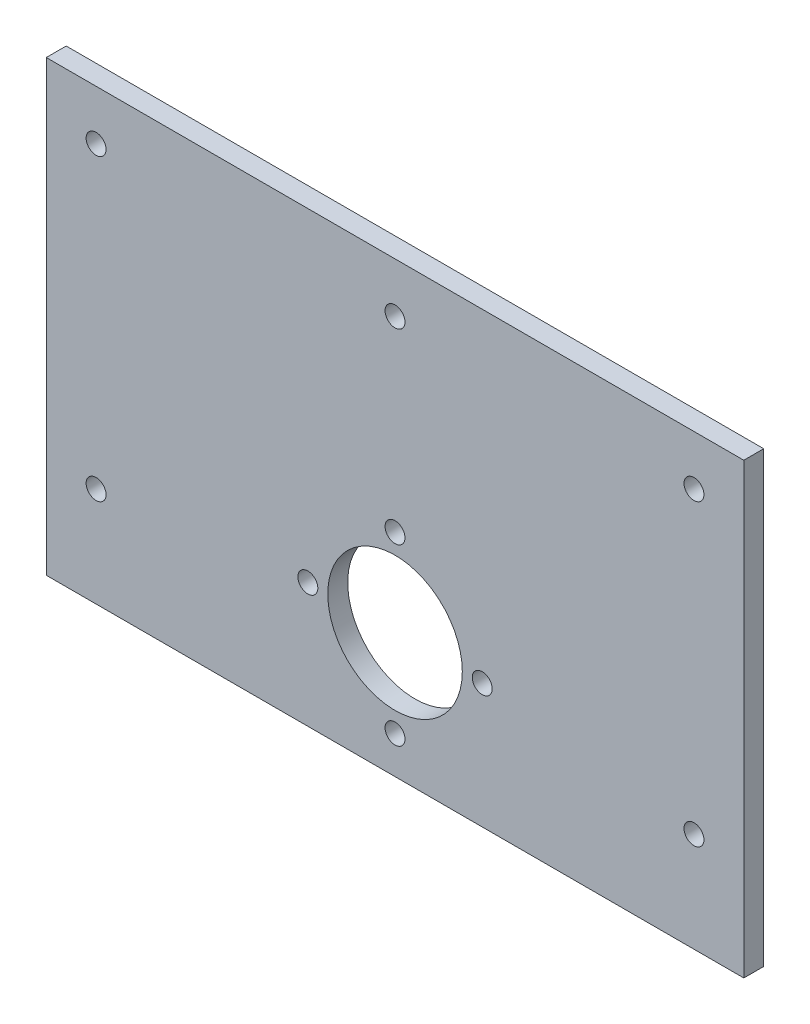
ISO-10303-21;
HEADER;
FILE_DESCRIPTION(('STEP AP214'),'2;1');
FILE_NAME('part.step','',(''),(''),'','','');
FILE_SCHEMA(('AUTOMOTIVE_DESIGN { 1 0 10303 214 1 1 1 1 }'));
ENDSEC;
DATA;
#1=APPLICATION_CONTEXT('core data for automotive mechanical design processes');
#2=APPLICATION_PROTOCOL_DEFINITION('international standard','automotive_design',2000,#1);
#3=PRODUCT_CONTEXT('',#1,'mechanical');
#4=PRODUCT('Part','Part','',(#3));
#5=PRODUCT_RELATED_PRODUCT_CATEGORY('part','',(#4));
#6=PRODUCT_DEFINITION_FORMATION('','',#4);
#7=PRODUCT_DEFINITION_CONTEXT('part definition',#1,'design');
#8=PRODUCT_DEFINITION('design','',#6,#7);
#9=PRODUCT_DEFINITION_SHAPE('','',#8);
#10=(LENGTH_UNIT() NAMED_UNIT(*) SI_UNIT(.MILLI.,.METRE.));
#11=(NAMED_UNIT(*) PLANE_ANGLE_UNIT() SI_UNIT($,.RADIAN.));
#12=(NAMED_UNIT(*) SI_UNIT($,.STERADIAN.) SOLID_ANGLE_UNIT());
#13=UNCERTAINTY_MEASURE_WITH_UNIT(LENGTH_MEASURE(1.E-05),#10,'distance_accuracy_value','');
#14=(GEOMETRIC_REPRESENTATION_CONTEXT(3) GLOBAL_UNCERTAINTY_ASSIGNED_CONTEXT((#13)) GLOBAL_UNIT_ASSIGNED_CONTEXT((#10,
#11,#12)) REPRESENTATION_CONTEXT('',''));
#15=CARTESIAN_POINT('',(0.,0.,0.));
#16=DIRECTION('',(0.,0.,1.));
#17=DIRECTION('',(1.,0.,0.));
#18=AXIS2_PLACEMENT_3D('',#15,#16,#17);
#19=CARTESIAN_POINT('',(0.,0.,4.));
#20=DIRECTION('',(0.,0.,-1.));
#21=DIRECTION('',(-1.,0.,0.));
#22=AXIS2_PLACEMENT_3D('',#19,#20,#21);
#23=PLANE('',#22);
#24=CARTESIAN_POINT('',(60.,-25.,4.));
#25=DIRECTION('',(0.,0.,1.));
#26=DIRECTION('',(-1.,0.,0.));
#27=AXIS2_PLACEMENT_3D('',#24,#25,#26);
#28=CIRCLE('',#27,2.);
#29=CARTESIAN_POINT('',(58.,-25.,4.));
#30=VERTEX_POINT('',#29);
#31=EDGE_CURVE('E202',#30,#30,#28,.T.);
#32=ORIENTED_EDGE('',*,*,#31,.F.);
#33=EDGE_LOOP('',(#32));
#34=FACE_BOUND('',#33,.T.);
#35=CARTESIAN_POINT('',(-60.,-25.,4.));
#36=DIRECTION('',(0.,0.,1.));
#37=DIRECTION('',(1.,0.,0.));
#38=AXIS2_PLACEMENT_3D('',#35,#36,#37);
#39=CIRCLE('',#38,2.);
#40=CARTESIAN_POINT('',(-58.,-25.,4.));
#41=VERTEX_POINT('',#40);
#42=EDGE_CURVE('E194',#41,#41,#39,.T.);
#43=ORIENTED_EDGE('',*,*,#42,.F.);
#44=EDGE_LOOP('',(#43));
#45=FACE_BOUND('',#44,.T.);
#46=CARTESIAN_POINT('',(60.,35.,4.));
#47=DIRECTION('',(0.,0.,1.));
#48=DIRECTION('',(1.,0.,0.));
#49=AXIS2_PLACEMENT_3D('',#46,#47,#48);
#50=CIRCLE('',#49,2.);
#51=CARTESIAN_POINT('',(62.,35.,4.));
#52=VERTEX_POINT('',#51);
#53=EDGE_CURVE('E178',#52,#52,#50,.T.);
#54=ORIENTED_EDGE('',*,*,#53,.F.);
#55=EDGE_LOOP('',(#54));
#56=FACE_BOUND('',#55,.T.);
#57=CARTESIAN_POINT('',(-60.,35.,4.));
#58=DIRECTION('',(0.,0.,1.));
#59=DIRECTION('',(1.,0.,0.));
#60=AXIS2_PLACEMENT_3D('',#57,#58,#59);
#61=CIRCLE('',#60,2.);
#62=CARTESIAN_POINT('',(-58.,35.,4.));
#63=VERTEX_POINT('',#62);
#64=EDGE_CURVE('E187',#63,#63,#61,.T.);
#65=ORIENTED_EDGE('',*,*,#64,.F.);
#66=EDGE_LOOP('',(#65));
#67=FACE_BOUND('',#66,.T.);
#68=CARTESIAN_POINT('',(0.,35.,4.));
#69=DIRECTION('',(0.,0.,1.));
#70=DIRECTION('',(1.,0.,0.));
#71=AXIS2_PLACEMENT_3D('',#68,#69,#70);
#72=CIRCLE('',#71,2.);
#73=CARTESIAN_POINT('',(2.00000000000002,35.,4.));
#74=VERTEX_POINT('',#73);
#75=EDGE_CURVE('E170',#74,#74,#72,.T.);
#76=ORIENTED_EDGE('',*,*,#75,.F.);
#77=EDGE_LOOP('',(#76));
#78=FACE_BOUND('',#77,.T.);
#79=DIRECTION('',(0.,1.,0.));
#80=VECTOR('',#79,1.);
#81=CARTESIAN_POINT('',(70.0000000000001,-45.,4.));
#82=LINE('',#81,#80);
#83=CARTESIAN_POINT('',(70.0000000000001,-45.,4.));
#84=VERTEX_POINT('',#83);
#85=CARTESIAN_POINT('',(70.,45.,4.));
#86=VERTEX_POINT('',#85);
#87=EDGE_CURVE('E92',#84,#86,#82,.T.);
#88=ORIENTED_EDGE('',*,*,#87,.T.);
#89=DIRECTION('',(-1.,0.,0.));
#90=VECTOR('',#89,1.);
#91=CARTESIAN_POINT('',(-70.,45.,4.));
#92=LINE('',#91,#90);
#93=CARTESIAN_POINT('',(-70.,45.,4.));
#94=VERTEX_POINT('',#93);
#95=EDGE_CURVE('E87',#86,#94,#92,.T.);
#96=ORIENTED_EDGE('',*,*,#95,.T.);
#97=DIRECTION('',(0.,-1.,0.));
#98=VECTOR('',#97,1.);
#99=CARTESIAN_POINT('',(-70.,-45.,4.));
#100=LINE('',#99,#98);
#101=CARTESIAN_POINT('',(-70.,-45.,4.));
#102=VERTEX_POINT('',#101);
#103=EDGE_CURVE('E90',#94,#102,#100,.T.);
#104=ORIENTED_EDGE('',*,*,#103,.T.);
#105=DIRECTION('',(1.,0.,0.));
#106=VECTOR('',#105,1.);
#107=CARTESIAN_POINT('',(-70.,-45.,4.));
#108=LINE('',#107,#106);
#109=EDGE_CURVE('E57',#102,#84,#108,.T.);
#110=ORIENTED_EDGE('',*,*,#109,.T.);
#111=EDGE_LOOP('',(#88,#96,#104,#110));
#112=FACE_BOUND('',#111,.T.);
#113=CARTESIAN_POINT('',(-2.81942531270712E-13,-2.5,4.));
#114=DIRECTION('',(0.,0.,1.));
#115=DIRECTION('',(1.,0.,0.));
#116=AXIS2_PLACEMENT_3D('',#113,#114,#115);
#117=CIRCLE('',#116,1.99999999999999);
#118=CARTESIAN_POINT('',(1.99999999999971,-2.5,4.));
#119=VERTEX_POINT('',#118);
#120=EDGE_CURVE('E112',#119,#119,#117,.T.);
#121=ORIENTED_EDGE('',*,*,#120,.F.);
#122=EDGE_LOOP('',(#121));
#123=FACE_BOUND('',#122,.T.);
#124=CARTESIAN_POINT('',(-2.91433543964104E-13,-20.,4.));
#125=DIRECTION('',(0.,0.,1.));
#126=DIRECTION('',(1.,0.,0.));
#127=AXIS2_PLACEMENT_3D('',#124,#125,#126);
#128=CIRCLE('',#127,13.5);
#129=CARTESIAN_POINT('',(13.4999999999997,-20.,4.));
#130=VERTEX_POINT('',#129);
#131=EDGE_CURVE('E134',#130,#130,#128,.T.);
#132=ORIENTED_EDGE('',*,*,#131,.F.);
#133=EDGE_LOOP('',(#132));
#134=FACE_BOUND('',#133,.T.);
#135=CARTESIAN_POINT('',(17.4999999999997,-20.,4.));
#136=DIRECTION('',(0.,0.,1.));
#137=DIRECTION('',(1.,0.,0.));
#138=AXIS2_PLACEMENT_3D('',#135,#136,#137);
#139=CIRCLE('',#138,2.);
#140=CARTESIAN_POINT('',(19.4999999999997,-20.,4.));
#141=VERTEX_POINT('',#140);
#142=EDGE_CURVE('E142',#141,#141,#139,.T.);
#143=ORIENTED_EDGE('',*,*,#142,.F.);
#144=EDGE_LOOP('',(#143));
#145=FACE_BOUND('',#144,.T.);
#146=CARTESIAN_POINT('',(-2.98781424758988E-13,-37.5,4.));
#147=DIRECTION('',(0.,0.,1.));
#148=DIRECTION('',(1.,0.,0.));
#149=AXIS2_PLACEMENT_3D('',#146,#147,#148);
#150=CIRCLE('',#149,2.00000000000001);
#151=CARTESIAN_POINT('',(1.99999999999971,-37.5,4.));
#152=VERTEX_POINT('',#151);
#153=EDGE_CURVE('E150',#152,#152,#150,.T.);
#154=ORIENTED_EDGE('',*,*,#153,.F.);
#155=EDGE_LOOP('',(#154));
#156=FACE_BOUND('',#155,.T.);
#157=CARTESIAN_POINT('',(-17.5000000000003,-20.,4.));
#158=DIRECTION('',(0.,0.,1.));
#159=DIRECTION('',(1.,0.,0.));
#160=AXIS2_PLACEMENT_3D('',#157,#158,#159);
#161=CIRCLE('',#160,2.);
#162=CARTESIAN_POINT('',(-15.5000000000003,-20.,4.));
#163=VERTEX_POINT('',#162);
#164=EDGE_CURVE('E158',#163,#163,#161,.T.);
#165=ORIENTED_EDGE('',*,*,#164,.F.);
#166=EDGE_LOOP('',(#165));
#167=FACE_BOUND('',#166,.T.);
#168=ADVANCED_FACE('F39',(#34,#45,#56,#67,#78,#112,#123,#134,#145,#156,#167),#23,.F.);
#169=CARTESIAN_POINT('',(0.,0.,0.));
#170=DIRECTION('',(0.,0.,-1.));
#171=DIRECTION('',(-1.,0.,0.));
#172=AXIS2_PLACEMENT_3D('',#169,#170,#171);
#173=PLANE('',#172);
#174=CARTESIAN_POINT('',(60.,-25.,0.));
#175=DIRECTION('',(0.,0.,1.));
#176=DIRECTION('',(-1.,0.,0.));
#177=AXIS2_PLACEMENT_3D('',#174,#175,#176);
#178=CIRCLE('',#177,2.);
#179=CARTESIAN_POINT('',(58.,-25.,0.));
#180=VERTEX_POINT('',#179);
#181=EDGE_CURVE('E198',#180,#180,#178,.T.);
#182=ORIENTED_EDGE('',*,*,#181,.T.);
#183=EDGE_LOOP('',(#182));
#184=FACE_BOUND('',#183,.T.);
#185=CARTESIAN_POINT('',(-60.,-25.,0.));
#186=DIRECTION('',(0.,0.,1.));
#187=DIRECTION('',(1.,0.,0.));
#188=AXIS2_PLACEMENT_3D('',#185,#186,#187);
#189=CIRCLE('',#188,2.);
#190=CARTESIAN_POINT('',(-58.,-25.,0.));
#191=VERTEX_POINT('',#190);
#192=EDGE_CURVE('E183',#191,#191,#189,.T.);
#193=ORIENTED_EDGE('',*,*,#192,.T.);
#194=EDGE_LOOP('',(#193));
#195=FACE_BOUND('',#194,.T.);
#196=CARTESIAN_POINT('',(60.,35.,0.));
#197=DIRECTION('',(0.,0.,1.));
#198=DIRECTION('',(1.,0.,0.));
#199=AXIS2_PLACEMENT_3D('',#196,#197,#198);
#200=CIRCLE('',#199,2.);
#201=CARTESIAN_POINT('',(62.,35.,0.));
#202=VERTEX_POINT('',#201);
#203=EDGE_CURVE('E182',#202,#202,#200,.T.);
#204=ORIENTED_EDGE('',*,*,#203,.T.);
#205=EDGE_LOOP('',(#204));
#206=FACE_BOUND('',#205,.T.);
#207=CARTESIAN_POINT('',(-60.,35.,0.));
#208=DIRECTION('',(0.,0.,1.));
#209=DIRECTION('',(1.,0.,0.));
#210=AXIS2_PLACEMENT_3D('',#207,#208,#209);
#211=CIRCLE('',#210,2.);
#212=CARTESIAN_POINT('',(-58.,35.,0.));
#213=VERTEX_POINT('',#212);
#214=EDGE_CURVE('E174',#213,#213,#211,.T.);
#215=ORIENTED_EDGE('',*,*,#214,.T.);
#216=EDGE_LOOP('',(#215));
#217=FACE_BOUND('',#216,.T.);
#218=CARTESIAN_POINT('',(0.,35.,0.));
#219=DIRECTION('',(0.,0.,1.));
#220=DIRECTION('',(1.,0.,0.));
#221=AXIS2_PLACEMENT_3D('',#218,#219,#220);
#222=CIRCLE('',#221,2.);
#223=CARTESIAN_POINT('',(2.00000000000002,35.,0.));
#224=VERTEX_POINT('',#223);
#225=EDGE_CURVE('E166',#224,#224,#222,.T.);
#226=ORIENTED_EDGE('',*,*,#225,.T.);
#227=EDGE_LOOP('',(#226));
#228=FACE_BOUND('',#227,.T.);
#229=CARTESIAN_POINT('',(-2.98781424758988E-13,-37.5,0.));
#230=DIRECTION('',(0.,0.,1.));
#231=DIRECTION('',(1.,0.,0.));
#232=AXIS2_PLACEMENT_3D('',#229,#230,#231);
#233=CIRCLE('',#232,2.00000000000001);
#234=CARTESIAN_POINT('',(1.99999999999971,-37.5,0.));
#235=VERTEX_POINT('',#234);
#236=EDGE_CURVE('E154',#235,#235,#233,.T.);
#237=ORIENTED_EDGE('',*,*,#236,.T.);
#238=EDGE_LOOP('',(#237));
#239=FACE_BOUND('',#238,.T.);
#240=CARTESIAN_POINT('',(-2.91433543964104E-13,-20.,0.));
#241=DIRECTION('',(0.,0.,1.));
#242=DIRECTION('',(1.,0.,0.));
#243=AXIS2_PLACEMENT_3D('',#240,#241,#242);
#244=CIRCLE('',#243,13.5);
#245=CARTESIAN_POINT('',(13.4999999999997,-20.,0.));
#246=VERTEX_POINT('',#245);
#247=EDGE_CURVE('E138',#246,#246,#244,.T.);
#248=ORIENTED_EDGE('',*,*,#247,.T.);
#249=EDGE_LOOP('',(#248));
#250=FACE_BOUND('',#249,.T.);
#251=DIRECTION('',(0.,1.,0.));
#252=VECTOR('',#251,1.);
#253=CARTESIAN_POINT('',(70.0000000000001,-45.,0.));
#254=LINE('',#253,#252);
#255=CARTESIAN_POINT('',(70.0000000000001,-45.,0.));
#256=VERTEX_POINT('',#255);
#257=CARTESIAN_POINT('',(70.,45.,0.));
#258=VERTEX_POINT('',#257);
#259=EDGE_CURVE('E108',#256,#258,#254,.T.);
#260=ORIENTED_EDGE('',*,*,#259,.F.);
#261=DIRECTION('',(1.,0.,0.));
#262=VECTOR('',#261,1.);
#263=CARTESIAN_POINT('',(-70.,-45.,0.));
#264=LINE('',#263,#262);
#265=CARTESIAN_POINT('',(-70.,-45.,0.));
#266=VERTEX_POINT('',#265);
#267=EDGE_CURVE('E80',#266,#256,#264,.T.);
#268=ORIENTED_EDGE('',*,*,#267,.F.);
#269=DIRECTION('',(0.,-1.,0.));
#270=VECTOR('',#269,1.);
#271=CARTESIAN_POINT('',(-70.,-45.,0.));
#272=LINE('',#271,#270);
#273=CARTESIAN_POINT('',(-70.,45.,0.));
#274=VERTEX_POINT('',#273);
#275=EDGE_CURVE('E74',#274,#266,#272,.T.);
#276=ORIENTED_EDGE('',*,*,#275,.F.);
#277=DIRECTION('',(-1.,0.,0.));
#278=VECTOR('',#277,1.);
#279=CARTESIAN_POINT('',(-70.,45.,0.));
#280=LINE('',#279,#278);
#281=EDGE_CURVE('E97',#258,#274,#280,.T.);
#282=ORIENTED_EDGE('',*,*,#281,.F.);
#283=EDGE_LOOP('',(#260,#268,#276,#282));
#284=FACE_BOUND('',#283,.T.);
#285=CARTESIAN_POINT('',(-2.81942531270712E-13,-2.5,0.));
#286=DIRECTION('',(0.,0.,1.));
#287=DIRECTION('',(1.,0.,0.));
#288=AXIS2_PLACEMENT_3D('',#285,#286,#287);
#289=CIRCLE('',#288,1.99999999999999);
#290=CARTESIAN_POINT('',(1.99999999999971,-2.5,0.));
#291=VERTEX_POINT('',#290);
#292=EDGE_CURVE('E130',#291,#291,#289,.T.);
#293=ORIENTED_EDGE('',*,*,#292,.T.);
#294=EDGE_LOOP('',(#293));
#295=FACE_BOUND('',#294,.T.);
#296=CARTESIAN_POINT('',(17.4999999999997,-20.,0.));
#297=DIRECTION('',(0.,0.,1.));
#298=DIRECTION('',(1.,0.,0.));
#299=AXIS2_PLACEMENT_3D('',#296,#297,#298);
#300=CIRCLE('',#299,2.);
#301=CARTESIAN_POINT('',(19.4999999999997,-20.,0.));
#302=VERTEX_POINT('',#301);
#303=EDGE_CURVE('E146',#302,#302,#300,.T.);
#304=ORIENTED_EDGE('',*,*,#303,.T.);
#305=EDGE_LOOP('',(#304));
#306=FACE_BOUND('',#305,.T.);
#307=CARTESIAN_POINT('',(-17.5000000000003,-20.,0.));
#308=DIRECTION('',(0.,0.,1.));
#309=DIRECTION('',(1.,0.,0.));
#310=AXIS2_PLACEMENT_3D('',#307,#308,#309);
#311=CIRCLE('',#310,2.);
#312=CARTESIAN_POINT('',(-15.5000000000003,-20.,0.));
#313=VERTEX_POINT('',#312);
#314=EDGE_CURVE('E162',#313,#313,#311,.T.);
#315=ORIENTED_EDGE('',*,*,#314,.T.);
#316=EDGE_LOOP('',(#315));
#317=FACE_BOUND('',#316,.T.);
#318=ADVANCED_FACE('F125',(#184,#195,#206,#217,#228,#239,#250,#284,#295,#306,#317),#173,.T.);
#319=CARTESIAN_POINT('',(70.0000000000001,-45.,4.));
#320=DIRECTION('',(-1.,0.,0.));
#321=DIRECTION('',(0.,-1.,0.));
#322=AXIS2_PLACEMENT_3D('',#319,#320,#321);
#323=PLANE('',#322);
#324=ORIENTED_EDGE('',*,*,#259,.T.);
#325=DIRECTION('',(0.,0.,-1.));
#326=VECTOR('',#325,1.);
#327=CARTESIAN_POINT('',(70.,45.,4.));
#328=LINE('',#327,#326);
#329=EDGE_CURVE('E11',#86,#258,#328,.T.);
#330=ORIENTED_EDGE('',*,*,#329,.F.);
#331=ORIENTED_EDGE('',*,*,#87,.F.);
#332=DIRECTION('',(0.,0.,-1.));
#333=VECTOR('',#332,1.);
#334=CARTESIAN_POINT('',(70.0000000000001,-45.,4.));
#335=LINE('',#334,#333);
#336=EDGE_CURVE('E104',#84,#256,#335,.T.);
#337=ORIENTED_EDGE('',*,*,#336,.T.);
#338=EDGE_LOOP('',(#324,#330,#331,#337));
#339=FACE_BOUND('',#338,.T.);
#340=ADVANCED_FACE('F41',(#339),#323,.F.);
#341=CARTESIAN_POINT('',(-70.,45.,4.));
#342=DIRECTION('',(0.,-1.,0.));
#343=DIRECTION('',(1.,0.,0.));
#344=AXIS2_PLACEMENT_3D('',#341,#342,#343);
#345=PLANE('',#344);
#346=ORIENTED_EDGE('',*,*,#281,.T.);
#347=DIRECTION('',(0.,0.,-1.));
#348=VECTOR('',#347,1.);
#349=CARTESIAN_POINT('',(-70.,45.,4.));
#350=LINE('',#349,#348);
#351=EDGE_CURVE('E49',#94,#274,#350,.T.);
#352=ORIENTED_EDGE('',*,*,#351,.F.);
#353=ORIENTED_EDGE('',*,*,#95,.F.);
#354=ORIENTED_EDGE('',*,*,#329,.T.);
#355=EDGE_LOOP('',(#346,#352,#353,#354));
#356=FACE_BOUND('',#355,.T.);
#357=ADVANCED_FACE('F96',(#356),#345,.F.);
#358=CARTESIAN_POINT('',(-70.,-45.,4.));
#359=DIRECTION('',(1.,0.,0.));
#360=DIRECTION('',(0.,1.,0.));
#361=AXIS2_PLACEMENT_3D('',#358,#359,#360);
#362=PLANE('',#361);
#363=ORIENTED_EDGE('',*,*,#275,.T.);
#364=DIRECTION('',(0.,0.,-1.));
#365=VECTOR('',#364,1.);
#366=CARTESIAN_POINT('',(-70.,-45.,4.));
#367=LINE('',#366,#365);
#368=EDGE_CURVE('E99',#102,#266,#367,.T.);
#369=ORIENTED_EDGE('',*,*,#368,.F.);
#370=ORIENTED_EDGE('',*,*,#103,.F.);
#371=ORIENTED_EDGE('',*,*,#351,.T.);
#372=EDGE_LOOP('',(#363,#369,#370,#371));
#373=FACE_BOUND('',#372,.T.);
#374=ADVANCED_FACE('F100',(#373),#362,.F.);
#375=CARTESIAN_POINT('',(-70.,-45.,4.));
#376=DIRECTION('',(0.,1.,0.));
#377=DIRECTION('',(-1.,0.,0.));
#378=AXIS2_PLACEMENT_3D('',#375,#376,#377);
#379=PLANE('',#378);
#380=ORIENTED_EDGE('',*,*,#267,.T.);
#381=ORIENTED_EDGE('',*,*,#336,.F.);
#382=ORIENTED_EDGE('',*,*,#109,.F.);
#383=ORIENTED_EDGE('',*,*,#368,.T.);
#384=EDGE_LOOP('',(#380,#381,#382,#383));
#385=FACE_BOUND('',#384,.T.);
#386=ADVANCED_FACE('F122',(#385),#379,.F.);
#387=CARTESIAN_POINT('',(-2.81942531270712E-13,-2.5,4.));
#388=DIRECTION('',(0.,0.,-1.));
#389=DIRECTION('',(-1.,0.,0.));
#390=AXIS2_PLACEMENT_3D('',#387,#388,#389);
#391=CYLINDRICAL_SURFACE('',#390,1.99999999999999);
#392=ORIENTED_EDGE('',*,*,#120,.T.);
#393=EDGE_LOOP('',(#392));
#394=FACE_BOUND('',#393,.T.);
#395=ORIENTED_EDGE('',*,*,#292,.F.);
#396=EDGE_LOOP('',(#395));
#397=FACE_BOUND('',#396,.T.);
#398=ADVANCED_FACE('F259',(#394,#397),#391,.F.);
#399=CARTESIAN_POINT('',(-2.91433543964104E-13,-20.,4.));
#400=DIRECTION('',(0.,0.,-1.));
#401=DIRECTION('',(-1.,0.,0.));
#402=AXIS2_PLACEMENT_3D('',#399,#400,#401);
#403=CYLINDRICAL_SURFACE('',#402,13.5);
#404=ORIENTED_EDGE('',*,*,#131,.T.);
#405=EDGE_LOOP('',(#404));
#406=FACE_BOUND('',#405,.T.);
#407=ORIENTED_EDGE('',*,*,#247,.F.);
#408=EDGE_LOOP('',(#407));
#409=FACE_BOUND('',#408,.T.);
#410=ADVANCED_FACE('F255',(#406,#409),#403,.F.);
#411=CARTESIAN_POINT('',(17.4999999999997,-20.,4.));
#412=DIRECTION('',(0.,0.,-1.));
#413=DIRECTION('',(-1.,0.,0.));
#414=AXIS2_PLACEMENT_3D('',#411,#412,#413);
#415=CYLINDRICAL_SURFACE('',#414,2.);
#416=ORIENTED_EDGE('',*,*,#142,.T.);
#417=EDGE_LOOP('',(#416));
#418=FACE_BOUND('',#417,.T.);
#419=ORIENTED_EDGE('',*,*,#303,.F.);
#420=EDGE_LOOP('',(#419));
#421=FACE_BOUND('',#420,.T.);
#422=ADVANCED_FACE('F251',(#418,#421),#415,.F.);
#423=CARTESIAN_POINT('',(-2.98781424758988E-13,-37.5,4.));
#424=DIRECTION('',(0.,0.,-1.));
#425=DIRECTION('',(-1.,0.,0.));
#426=AXIS2_PLACEMENT_3D('',#423,#424,#425);
#427=CYLINDRICAL_SURFACE('',#426,2.00000000000001);
#428=ORIENTED_EDGE('',*,*,#153,.T.);
#429=EDGE_LOOP('',(#428));
#430=FACE_BOUND('',#429,.T.);
#431=ORIENTED_EDGE('',*,*,#236,.F.);
#432=EDGE_LOOP('',(#431));
#433=FACE_BOUND('',#432,.T.);
#434=ADVANCED_FACE('F243',(#430,#433),#427,.F.);
#435=CARTESIAN_POINT('',(-17.5000000000003,-20.,4.));
#436=DIRECTION('',(0.,0.,-1.));
#437=DIRECTION('',(-1.,0.,0.));
#438=AXIS2_PLACEMENT_3D('',#435,#436,#437);
#439=CYLINDRICAL_SURFACE('',#438,2.);
#440=ORIENTED_EDGE('',*,*,#164,.T.);
#441=EDGE_LOOP('',(#440));
#442=FACE_BOUND('',#441,.T.);
#443=ORIENTED_EDGE('',*,*,#314,.F.);
#444=EDGE_LOOP('',(#443));
#445=FACE_BOUND('',#444,.T.);
#446=ADVANCED_FACE('F233',(#442,#445),#439,.F.);
#447=CARTESIAN_POINT('',(0.,35.,0.));
#448=DIRECTION('',(0.,0.,1.));
#449=DIRECTION('',(1.,0.,0.));
#450=AXIS2_PLACEMENT_3D('',#447,#448,#449);
#451=CYLINDRICAL_SURFACE('',#450,2.);
#452=ORIENTED_EDGE('',*,*,#225,.F.);
#453=EDGE_LOOP('',(#452));
#454=FACE_BOUND('',#453,.T.);
#455=ORIENTED_EDGE('',*,*,#75,.T.);
#456=EDGE_LOOP('',(#455));
#457=FACE_BOUND('',#456,.T.);
#458=ADVANCED_FACE('F230',(#454,#457),#451,.F.);
#459=CARTESIAN_POINT('',(-60.,35.,0.));
#460=DIRECTION('',(0.,0.,1.));
#461=DIRECTION('',(1.,0.,0.));
#462=AXIS2_PLACEMENT_3D('',#459,#460,#461);
#463=CYLINDRICAL_SURFACE('',#462,2.);
#464=ORIENTED_EDGE('',*,*,#214,.F.);
#465=EDGE_LOOP('',(#464));
#466=FACE_BOUND('',#465,.T.);
#467=ORIENTED_EDGE('',*,*,#64,.T.);
#468=EDGE_LOOP('',(#467));
#469=FACE_BOUND('',#468,.T.);
#470=ADVANCED_FACE('F232',(#466,#469),#463,.F.);
#471=CARTESIAN_POINT('',(60.,35.,0.));
#472=DIRECTION('',(0.,0.,1.));
#473=DIRECTION('',(1.,0.,0.));
#474=AXIS2_PLACEMENT_3D('',#471,#472,#473);
#475=CYLINDRICAL_SURFACE('',#474,2.);
#476=ORIENTED_EDGE('',*,*,#203,.F.);
#477=EDGE_LOOP('',(#476));
#478=FACE_BOUND('',#477,.T.);
#479=ORIENTED_EDGE('',*,*,#53,.T.);
#480=EDGE_LOOP('',(#479));
#481=FACE_BOUND('',#480,.T.);
#482=ADVANCED_FACE('F240',(#478,#481),#475,.F.);
#483=CARTESIAN_POINT('',(-60.,-25.,0.));
#484=DIRECTION('',(0.,0.,1.));
#485=DIRECTION('',(1.,0.,0.));
#486=AXIS2_PLACEMENT_3D('',#483,#484,#485);
#487=CYLINDRICAL_SURFACE('',#486,2.);
#488=ORIENTED_EDGE('',*,*,#192,.F.);
#489=EDGE_LOOP('',(#488));
#490=FACE_BOUND('',#489,.T.);
#491=ORIENTED_EDGE('',*,*,#42,.T.);
#492=EDGE_LOOP('',(#491));
#493=FACE_BOUND('',#492,.T.);
#494=ADVANCED_FACE('F215',(#490,#493),#487,.F.);
#495=CARTESIAN_POINT('',(60.,-25.,0.));
#496=DIRECTION('',(0.,0.,1.));
#497=DIRECTION('',(1.,0.,0.));
#498=AXIS2_PLACEMENT_3D('',#495,#496,#497);
#499=CYLINDRICAL_SURFACE('',#498,2.);
#500=ORIENTED_EDGE('',*,*,#181,.F.);
#501=EDGE_LOOP('',(#500));
#502=FACE_BOUND('',#501,.T.);
#503=ORIENTED_EDGE('',*,*,#31,.T.);
#504=EDGE_LOOP('',(#503));
#505=FACE_BOUND('',#504,.T.);
#506=ADVANCED_FACE('F212',(#502,#505),#499,.F.);
#507=CLOSED_SHELL('',(#168,#318,#340,#357,#374,#386,#398,#410,#422,#434,#446,#458,#470,#482,
#494,#506));
#508=MANIFOLD_SOLID_BREP('B2',#507);
#509=ADVANCED_BREP_SHAPE_REPRESENTATION('',(#18,#508),#14);
#510=SHAPE_DEFINITION_REPRESENTATION(#9,#509);
ENDSEC;
END-ISO-10303-21;
